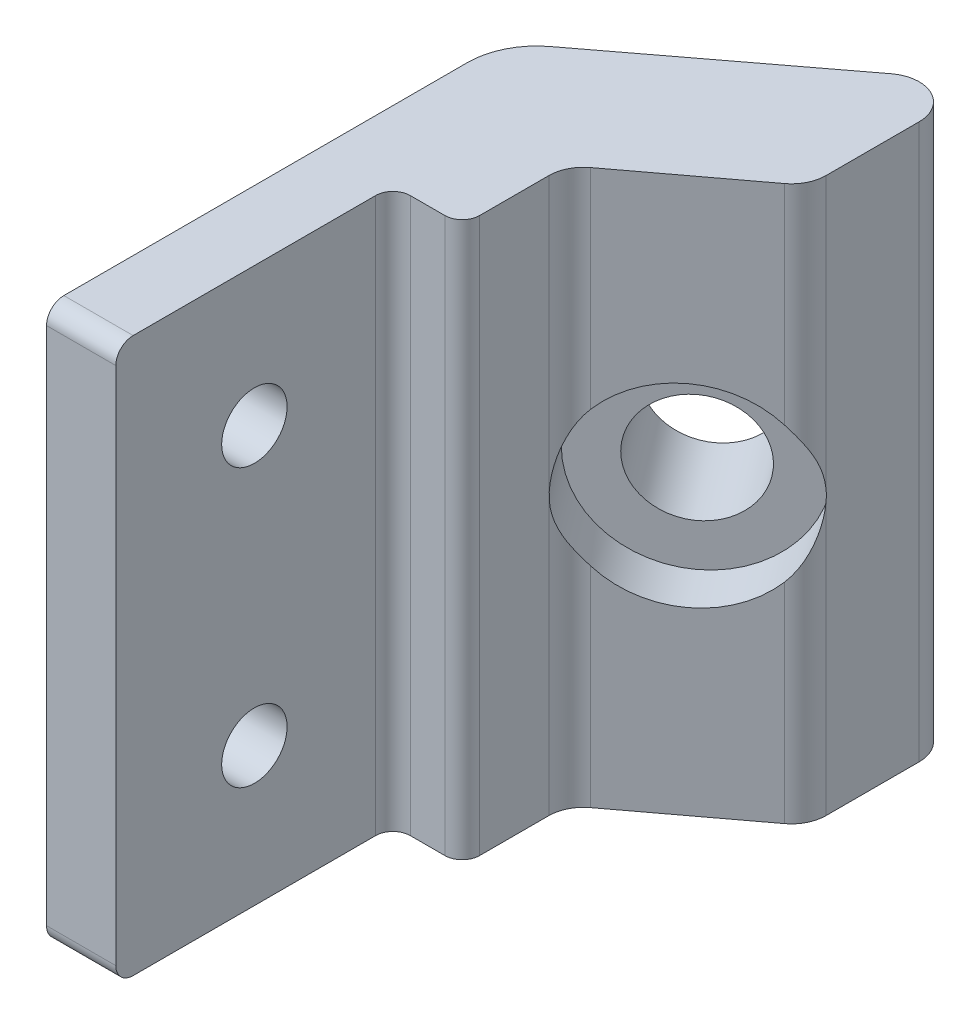
ISO-10303-21;
HEADER;
FILE_DESCRIPTION(('STEP AP214'),'2;1');
FILE_NAME('part.step','',(''),(''),'','','');
FILE_SCHEMA(('AUTOMOTIVE_DESIGN { 1 0 10303 214 1 1 1 1 }'));
ENDSEC;
DATA;
#1=APPLICATION_CONTEXT('core data for automotive mechanical design processes');
#2=APPLICATION_PROTOCOL_DEFINITION('international standard','automotive_design',2000,#1);
#3=PRODUCT_CONTEXT('',#1,'mechanical');
#4=PRODUCT('Part','Part','',(#3));
#5=PRODUCT_RELATED_PRODUCT_CATEGORY('part','',(#4));
#6=PRODUCT_DEFINITION_FORMATION('','',#4);
#7=PRODUCT_DEFINITION_CONTEXT('part definition',#1,'design');
#8=PRODUCT_DEFINITION('design','',#6,#7);
#9=PRODUCT_DEFINITION_SHAPE('','',#8);
#10=(LENGTH_UNIT() NAMED_UNIT(*) SI_UNIT(.MILLI.,.METRE.));
#11=(NAMED_UNIT(*) PLANE_ANGLE_UNIT() SI_UNIT($,.RADIAN.));
#12=(NAMED_UNIT(*) SI_UNIT($,.STERADIAN.) SOLID_ANGLE_UNIT());
#13=UNCERTAINTY_MEASURE_WITH_UNIT(LENGTH_MEASURE(1.E-05),#10,'distance_accuracy_value','');
#14=(GEOMETRIC_REPRESENTATION_CONTEXT(3) GLOBAL_UNCERTAINTY_ASSIGNED_CONTEXT((#13)) GLOBAL_UNIT_ASSIGNED_CONTEXT((#10,
#11,#12)) REPRESENTATION_CONTEXT('',''));
#15=CARTESIAN_POINT('',(0.,0.,0.));
#16=DIRECTION('',(0.,0.,1.));
#17=DIRECTION('',(1.,0.,0.));
#18=AXIS2_PLACEMENT_3D('',#15,#16,#17);
#19=CARTESIAN_POINT('',(31.75,-50.8,0.));
#20=DIRECTION('',(0.,0.,1.));
#21=DIRECTION('',(1.,0.,0.));
#22=AXIS2_PLACEMENT_3D('',#19,#20,#21);
#23=PLANE('',#22);
#24=DIRECTION('',(-1.,0.,0.));
#25=VECTOR('',#24,1.);
#26=CARTESIAN_POINT('',(38.1,-1.58750000000001,0.));
#27=LINE('',#26,#25);
#28=CARTESIAN_POINT('',(38.1,-1.58750000000001,0.));
#29=VERTEX_POINT('',#28);
#30=CARTESIAN_POINT('',(31.75,-1.58750000000001,0.));
#31=VERTEX_POINT('',#30);
#32=EDGE_CURVE('E449',#29,#31,#27,.T.);
#33=ORIENTED_EDGE('',*,*,#32,.T.);
#34=DIRECTION('',(0.,1.,0.));
#35=VECTOR('',#34,1.);
#36=CARTESIAN_POINT('',(31.75,-50.8,0.));
#37=LINE('',#36,#35);
#38=CARTESIAN_POINT('',(31.75,-49.2125,0.));
#39=VERTEX_POINT('',#38);
#40=EDGE_CURVE('E190',#39,#31,#37,.T.);
#41=ORIENTED_EDGE('',*,*,#40,.F.);
#42=DIRECTION('',(-1.,0.,0.));
#43=VECTOR('',#42,1.);
#44=CARTESIAN_POINT('',(38.1,-49.2125,0.));
#45=LINE('',#44,#43);
#46=CARTESIAN_POINT('',(38.1,-49.2125,0.));
#47=VERTEX_POINT('',#46);
#48=EDGE_CURVE('E178',#47,#39,#45,.T.);
#49=ORIENTED_EDGE('',*,*,#48,.F.);
#50=DIRECTION('',(0.,1.,0.));
#51=VECTOR('',#50,1.);
#52=CARTESIAN_POINT('',(38.1,-50.8,0.));
#53=LINE('',#52,#51);
#54=EDGE_CURVE('E188',#47,#29,#53,.T.);
#55=ORIENTED_EDGE('',*,*,#54,.T.);
#56=EDGE_LOOP('',(#33,#41,#49,#55));
#57=FACE_BOUND('',#56,.T.);
#58=ADVANCED_FACE('F41',(#57),#23,.T.);
#59=CARTESIAN_POINT('',(53.975,-50.8,-46.0375));
#60=DIRECTION('',(0.,1.,0.));
#61=DIRECTION('',(0.,0.,1.));
#62=AXIS2_PLACEMENT_3D('',#59,#60,#61);
#63=CYLINDRICAL_SURFACE('',#62,3.175);
#64=CARTESIAN_POINT('',(57.15,-24.876723173018,-46.0375));
#65=CARTESIAN_POINT('',(57.14999327222,-24.783701013145,-46.0283699328731));
#66=CARTESIAN_POINT('',(57.1499610112827,-24.6909378468294,-46.0168482108093));
#67=CARTESIAN_POINT('',(57.1496662931574,-24.5061123371493,-45.9893543044143));
#68=CARTESIAN_POINT('',(57.1494039353851,-24.4140497084356,-45.973384044153));
#69=CARTESIAN_POINT('',(57.1480058395352,-24.1395594876917,-45.9193811692682));
#70=CARTESIAN_POINT('',(57.146260962046,-23.9583278715682,-45.8752037862316));
#71=CARTESIAN_POINT('',(57.1393988303292,-23.5989312238263,-45.773281370185));
#72=CARTESIAN_POINT('',(57.1342652895989,-23.4207852872265,-45.7154716847611));
#73=CARTESIAN_POINT('',(57.118843679538,-23.0683854665152,-45.5892573580935));
#74=CARTESIAN_POINT('',(57.1085513139417,-22.894134953067,-45.5208439189089));
#75=CARTESIAN_POINT('',(57.0760624908927,-22.4851526412214,-45.3488176513561));
#76=CARTESIAN_POINT('',(57.0508541100002,-22.2521651437209,-45.2416075548382));
#77=CARTESIAN_POINT('',(56.9838304278257,-21.793510646844,-45.0170460876804));
#78=CARTESIAN_POINT('',(56.942010919944,-21.5678455174534,-44.8996921541108));
#79=CARTESIAN_POINT('',(56.8385319525899,-21.1254941713354,-44.6599012757596));
#80=CARTESIAN_POINT('',(56.7769836970921,-20.908765135179,-44.5374960948833));
#81=CARTESIAN_POINT('',(56.6306287075674,-20.4842109341543,-44.2914344582644));
#82=CARTESIAN_POINT('',(56.5458459460025,-20.276376845973,-44.1677794180404));
#83=CARTESIAN_POINT('',(56.3707535869939,-19.9148763675364,-43.9503872385135));
#84=CARTESIAN_POINT('',(56.2855632109669,-19.759181015043,-43.8559402846179));
#85=CARTESIAN_POINT('',(56.144172104766,-19.5311983988009,-43.7180872146868));
#86=CARTESIAN_POINT('',(56.094642872308,-19.4559623340291,-43.6726711878565));
#87=CARTESIAN_POINT('',(55.990883866188,-19.307622196993,-43.5836237381145));
#88=CARTESIAN_POINT('',(55.9366510597576,-19.2345195415141,-43.5399934937245));
#89=CARTESIAN_POINT('',(55.88,-19.1626033587517,-43.4975));
#90=B_SPLINE_CURVE_WITH_KNOTS('',3,(#64,#65,#66,#67,#68,#69,#70,#71,#72,#73,#74,#75,#76,#77,#78,
#79,#80,#81,#82,#83,#84,#85,#86,#87,#88,#89),.UNSPECIFIED.,.F.,.F.,(4,2,2,2,2,2,2,2,2,2,2,2,4),
(0.,0.280336922210032,0.560552781607499,1.11947716922896,1.68110759606796,2.24320652740722,
3.01545670389441,3.78790256972704,4.55606881399506,5.32344545882408,5.92561931434398,
6.22811781226873,6.53081282608392),.UNSPECIFIED.);
#91=CARTESIAN_POINT('',(57.15,-24.876723173018,-46.0375));
#92=VERTEX_POINT('',#91);
#93=CARTESIAN_POINT('',(55.88,-19.1626033587517,-43.4975));
#94=VERTEX_POINT('',#93);
#95=EDGE_CURVE('E253',#92,#94,#90,.T.);
#96=ORIENTED_EDGE('',*,*,#95,.F.);
#97=DIRECTION('',(0.,1.,0.));
#98=VECTOR('',#97,1.);
#99=CARTESIAN_POINT('',(57.15,-50.8,-46.0375));
#100=LINE('',#99,#98);
#101=CARTESIAN_POINT('',(57.15,0.,-46.0375));
#102=VERTEX_POINT('',#101);
#103=EDGE_CURVE('E215',#92,#102,#100,.T.);
#104=ORIENTED_EDGE('',*,*,#103,.T.);
#105=CARTESIAN_POINT('',(53.975,0.,-46.0375));
#106=DIRECTION('',(0.,1.,0.));
#107=DIRECTION('',(0.,0.,1.));
#108=AXIS2_PLACEMENT_3D('',#105,#106,#107);
#109=CIRCLE('',#108,3.175);
#110=CARTESIAN_POINT('',(55.88,0.,-43.4975));
#111=VERTEX_POINT('',#110);
#112=EDGE_CURVE('E377',#111,#102,#109,.T.);
#113=ORIENTED_EDGE('',*,*,#112,.F.);
#114=DIRECTION('',(0.,1.,0.));
#115=VECTOR('',#114,1.);
#116=CARTESIAN_POINT('',(55.88,-50.8,-43.4975));
#117=LINE('',#116,#115);
#118=EDGE_CURVE('E219',#94,#111,#117,.T.);
#119=ORIENTED_EDGE('',*,*,#118,.F.);
#120=EDGE_LOOP('',(#96,#104,#113,#119));
#121=FACE_BOUND('',#120,.T.);
#122=ADVANCED_FACE('F301',(#121),#63,.T.);
#123=CARTESIAN_POINT('',(45.72,-50.8,-35.8775));
#124=DIRECTION('',(0.6,0.,0.8));
#125=DIRECTION('',(0.8,0.,-0.6));
#126=AXIS2_PLACEMENT_3D('',#123,#124,#125);
#127=PLANE('',#126);
#128=CARTESIAN_POINT('',(50.8123309885672,-25.4,-39.6967482414254));
#129=DIRECTION('',(0.6,0.,0.8));
#130=DIRECTION('',(0.8,0.,-0.6));
#131=AXIS2_PLACEMENT_3D('',#128,#129,#130);
#132=CIRCLE('',#131,8.88999999999999);
#133=CARTESIAN_POINT('',(45.72,-19.1940667121497,-35.8775));
#134=VERTEX_POINT('',#133);
#135=EDGE_CURVE('E234',#94,#134,#132,.T.);
#136=ORIENTED_EDGE('',*,*,#135,.F.);
#137=ORIENTED_EDGE('',*,*,#118,.T.);
#138=DIRECTION('',(0.8,0.,-0.6));
#139=VECTOR('',#138,1.);
#140=CARTESIAN_POINT('',(45.72,0.,-35.8775));
#141=LINE('',#140,#139);
#142=CARTESIAN_POINT('',(45.72,0.,-35.8775));
#143=VERTEX_POINT('',#142);
#144=EDGE_CURVE('E374',#143,#111,#141,.T.);
#145=ORIENTED_EDGE('',*,*,#144,.F.);
#146=DIRECTION('',(0.,1.,0.));
#147=VECTOR('',#146,1.);
#148=CARTESIAN_POINT('',(45.72,-50.8,-35.8775));
#149=LINE('',#148,#147);
#150=EDGE_CURVE('E223',#134,#143,#149,.T.);
#151=ORIENTED_EDGE('',*,*,#150,.F.);
#152=EDGE_LOOP('',(#136,#137,#145,#151));
#153=FACE_BOUND('',#152,.T.);
#154=ADVANCED_FACE('F277',(#153),#127,.T.);
#155=CARTESIAN_POINT('',(48.2703191722165,-25.4,-43.086097329893));
#156=DIRECTION('',(-0.603638384029419,0.,-0.797258240049202));
#157=DIRECTION('',(-0.797258240049202,0.,0.603638384029419));
#158=AXIS2_PLACEMENT_3D('',#155,#156,#157);
#159=CYLINDRICAL_SURFACE('',#158,5.);
#160=CARTESIAN_POINT('',(42.9039739381949,-25.4,-50.1737230839304));
#161=DIRECTION('',(-0.603638384029419,0.,-0.797258240049202));
#162=DIRECTION('',(-0.797258240049202,0.,0.603638384029419));
#163=AXIS2_PLACEMENT_3D('',#160,#161,#162);
#164=CIRCLE('',#163,5.);
#165=CARTESIAN_POINT('',(38.9176827379489,-25.4,-47.1555311637833));
#166=VERTEX_POINT('',#165);
#167=EDGE_CURVE('E331',#166,#166,#164,.T.);
#168=ORIENTED_EDGE('',*,*,#167,.T.);
#169=EDGE_LOOP('',(#168));
#170=FACE_BOUND('',#169,.T.);
#171=CARTESIAN_POINT('',(48.2212346289432,-25.4,-43.1509259717074));
#172=DIRECTION('',(0.6,0.,0.8));
#173=DIRECTION('',(-0.8,0.,0.6));
#174=AXIS2_PLACEMENT_3D('',#171,#172,#173);
#175=ELLIPSE('',#174,5.0000518882534,5.);
#176=CARTESIAN_POINT('',(44.2211931183405,-25.4,-40.1508948387553));
#177=VERTEX_POINT('',#176);
#178=EDGE_CURVE('E228',#177,#177,#175,.F.);
#179=ORIENTED_EDGE('',*,*,#178,.F.);
#180=EDGE_LOOP('',(#179));
#181=FACE_BOUND('',#180,.T.);
#182=ADVANCED_FACE('F272',(#170,#181),#159,.F.);
#183=CARTESIAN_POINT('',(42.8625,-50.8,-26.9875));
#184=DIRECTION('',(0.,1.,0.));
#185=DIRECTION('',(0.,0.,1.));
#186=AXIS2_PLACEMENT_3D('',#183,#184,#185);
#187=CYLINDRICAL_SURFACE('',#186,1.5875);
#188=CARTESIAN_POINT('',(42.8625,0.,-26.9875));
#189=DIRECTION('',(0.,1.,0.));
#190=DIRECTION('',(0.,0.,-1.));
#191=AXIS2_PLACEMENT_3D('',#188,#189,#190);
#192=CIRCLE('',#191,1.5875);
#193=CARTESIAN_POINT('',(42.8625,0.,-25.4));
#194=VERTEX_POINT('',#193);
#195=CARTESIAN_POINT('',(44.45,0.,-26.9875));
#196=VERTEX_POINT('',#195);
#197=EDGE_CURVE('E365',#194,#196,#192,.T.);
#198=ORIENTED_EDGE('',*,*,#197,.F.);
#199=DIRECTION('',(0.,1.,0.));
#200=VECTOR('',#199,1.);
#201=CARTESIAN_POINT('',(42.8625,-50.8,-25.4));
#202=LINE('',#201,#200);
#203=CARTESIAN_POINT('',(42.8625,-50.8,-25.4));
#204=VERTEX_POINT('',#203);
#205=EDGE_CURVE('E55',#204,#194,#202,.T.);
#206=ORIENTED_EDGE('',*,*,#205,.F.);
#207=CARTESIAN_POINT('',(42.8625,-50.8,-26.9875));
#208=DIRECTION('',(0.,1.,0.));
#209=DIRECTION('',(0.,0.,-1.));
#210=AXIS2_PLACEMENT_3D('',#207,#208,#209);
#211=CIRCLE('',#210,1.5875);
#212=CARTESIAN_POINT('',(44.45,-50.8,-26.9875));
#213=VERTEX_POINT('',#212);
#214=EDGE_CURVE('E403',#204,#213,#211,.T.);
#215=ORIENTED_EDGE('',*,*,#214,.T.);
#216=DIRECTION('',(0.,1.,0.));
#217=VECTOR('',#216,1.);
#218=CARTESIAN_POINT('',(44.45,-50.8,-26.9875));
#219=LINE('',#218,#217);
#220=EDGE_CURVE('E226',#213,#196,#219,.T.);
#221=ORIENTED_EDGE('',*,*,#220,.T.);
#222=EDGE_LOOP('',(#198,#206,#215,#221));
#223=FACE_BOUND('',#222,.T.);
#224=ADVANCED_FACE('F43',(#223),#187,.T.);
#225=CARTESIAN_POINT('',(39.6875,-50.8,-25.4));
#226=DIRECTION('',(0.,0.,1.));
#227=DIRECTION('',(1.,0.,0.));
#228=AXIS2_PLACEMENT_3D('',#225,#226,#227);
#229=PLANE('',#228);
#230=DIRECTION('',(1.,0.,0.));
#231=VECTOR('',#230,1.);
#232=CARTESIAN_POINT('',(39.6875,0.,-25.4));
#233=LINE('',#232,#231);
#234=CARTESIAN_POINT('',(39.6875,0.,-25.4));
#235=VERTEX_POINT('',#234);
#236=EDGE_CURVE('E400',#235,#194,#233,.T.);
#237=ORIENTED_EDGE('',*,*,#236,.F.);
#238=DIRECTION('',(0.,1.,0.));
#239=VECTOR('',#238,1.);
#240=CARTESIAN_POINT('',(39.6875,-50.8,-25.4));
#241=LINE('',#240,#239);
#242=CARTESIAN_POINT('',(39.6875,-50.8,-25.4));
#243=VERTEX_POINT('',#242);
#244=EDGE_CURVE('E198',#243,#235,#241,.T.);
#245=ORIENTED_EDGE('',*,*,#244,.F.);
#246=DIRECTION('',(1.,0.,0.));
#247=VECTOR('',#246,1.);
#248=CARTESIAN_POINT('',(39.6875,-50.8,-25.4));
#249=LINE('',#248,#247);
#250=EDGE_CURVE('E227',#243,#204,#249,.T.);
#251=ORIENTED_EDGE('',*,*,#250,.T.);
#252=ORIENTED_EDGE('',*,*,#205,.T.);
#253=EDGE_LOOP('',(#237,#245,#251,#252));
#254=FACE_BOUND('',#253,.T.);
#255=ADVANCED_FACE('F288',(#254),#229,.T.);
#256=CARTESIAN_POINT('',(39.6875,-50.8,-23.8125));
#257=DIRECTION('',(0.,1.,0.));
#258=DIRECTION('',(0.,0.,1.));
#259=AXIS2_PLACEMENT_3D('',#256,#257,#258);
#260=CYLINDRICAL_SURFACE('',#259,1.5875);
#261=CARTESIAN_POINT('',(39.6875,0.,-23.8125));
#262=DIRECTION('',(0.,-1.,0.));
#263=DIRECTION('',(0.,0.,1.));
#264=AXIS2_PLACEMENT_3D('',#261,#262,#263);
#265=CIRCLE('',#264,1.5875);
#266=CARTESIAN_POINT('',(38.1,0.,-23.8125));
#267=VERTEX_POINT('',#266);
#268=EDGE_CURVE('E397',#267,#235,#265,.T.);
#269=ORIENTED_EDGE('',*,*,#268,.F.);
#270=DIRECTION('',(0.,1.,0.));
#271=VECTOR('',#270,1.);
#272=CARTESIAN_POINT('',(38.1,-50.8,-23.8125));
#273=LINE('',#272,#271);
#274=CARTESIAN_POINT('',(38.1,-50.8,-23.8125));
#275=VERTEX_POINT('',#274);
#276=EDGE_CURVE('E195',#275,#267,#273,.T.);
#277=ORIENTED_EDGE('',*,*,#276,.F.);
#278=CARTESIAN_POINT('',(39.6875,-50.8,-23.8125));
#279=DIRECTION('',(0.,-1.,0.));
#280=DIRECTION('',(0.,0.,1.));
#281=AXIS2_PLACEMENT_3D('',#278,#279,#280);
#282=CIRCLE('',#281,1.5875);
#283=EDGE_CURVE('E360',#275,#243,#282,.T.);
#284=ORIENTED_EDGE('',*,*,#283,.T.);
#285=ORIENTED_EDGE('',*,*,#244,.T.);
#286=EDGE_LOOP('',(#269,#277,#284,#285));
#287=FACE_BOUND('',#286,.T.);
#288=ADVANCED_FACE('F291',(#287),#260,.F.);
#289=CARTESIAN_POINT('',(38.1,-50.8,0.));
#290=DIRECTION('',(1.,0.,0.));
#291=DIRECTION('',(0.,0.,-1.));
#292=AXIS2_PLACEMENT_3D('',#289,#290,#291);
#293=PLANE('',#292);
#294=CARTESIAN_POINT('',(38.1,-1.5875,-1.5875));
#295=DIRECTION('',(1.,0.,0.));
#296=DIRECTION('',(0.,0.,1.));
#297=AXIS2_PLACEMENT_3D('',#294,#295,#296);
#298=CIRCLE('',#297,1.5875);
#299=CARTESIAN_POINT('',(38.1,0.,-1.58750000000001));
#300=VERTEX_POINT('',#299);
#301=EDGE_CURVE('E70',#300,#29,#298,.T.);
#302=ORIENTED_EDGE('',*,*,#301,.T.);
#303=ORIENTED_EDGE('',*,*,#54,.F.);
#304=CARTESIAN_POINT('',(38.1,-49.2125,-1.5875));
#305=DIRECTION('',(1.,0.,0.));
#306=DIRECTION('',(0.,0.,-1.));
#307=AXIS2_PLACEMENT_3D('',#304,#305,#306);
#308=CIRCLE('',#307,1.5875);
#309=CARTESIAN_POINT('',(38.1,-50.8,-1.58750000000001));
#310=VERTEX_POINT('',#309);
#311=EDGE_CURVE('E175',#47,#310,#308,.T.);
#312=ORIENTED_EDGE('',*,*,#311,.T.);
#313=DIRECTION('',(0.,0.,-1.));
#314=VECTOR('',#313,1.);
#315=CARTESIAN_POINT('',(38.1,-50.8,0.));
#316=LINE('',#315,#314);
#317=EDGE_CURVE('E358',#310,#275,#316,.T.);
#318=ORIENTED_EDGE('',*,*,#317,.T.);
#319=ORIENTED_EDGE('',*,*,#276,.T.);
#320=DIRECTION('',(0.,0.,-1.));
#321=VECTOR('',#320,1.);
#322=CARTESIAN_POINT('',(38.1,0.,0.));
#323=LINE('',#322,#321);
#324=EDGE_CURVE('E395',#300,#267,#323,.T.);
#325=ORIENTED_EDGE('',*,*,#324,.F.);
#326=EDGE_LOOP('',(#302,#303,#312,#318,#319,#325));
#327=FACE_BOUND('',#326,.T.);
#328=CARTESIAN_POINT('',(38.1,-38.1,-12.7));
#329=DIRECTION('',(-1.,0.,0.));
#330=DIRECTION('',(0.,0.,1.));
#331=AXIS2_PLACEMENT_3D('',#328,#329,#330);
#332=CIRCLE('',#331,3.);
#333=CARTESIAN_POINT('',(38.1,-38.1,-9.7));
#334=VERTEX_POINT('',#333);
#335=EDGE_CURVE('E444',#334,#334,#332,.T.);
#336=ORIENTED_EDGE('',*,*,#335,.T.);
#337=EDGE_LOOP('',(#336));
#338=FACE_BOUND('',#337,.T.);
#339=CARTESIAN_POINT('',(38.1,-12.7,-12.7));
#340=DIRECTION('',(-1.,0.,0.));
#341=DIRECTION('',(0.,0.,1.));
#342=AXIS2_PLACEMENT_3D('',#339,#340,#341);
#343=CIRCLE('',#342,3.);
#344=CARTESIAN_POINT('',(38.1,-12.7,-9.7));
#345=VERTEX_POINT('',#344);
#346=EDGE_CURVE('E237',#345,#345,#343,.T.);
#347=ORIENTED_EDGE('',*,*,#346,.T.);
#348=EDGE_LOOP('',(#347));
#349=FACE_BOUND('',#348,.T.);
#350=ADVANCED_FACE('F192',(#327,#338,#349),#293,.T.);
#351=CARTESIAN_POINT('',(31.75,-50.8,0.));
#352=DIRECTION('',(-1.,0.,0.));
#353=DIRECTION('',(0.,0.,1.));
#354=AXIS2_PLACEMENT_3D('',#351,#352,#353);
#355=PLANE('',#354);
#356=CARTESIAN_POINT('',(31.75,-1.5875,-1.5875));
#357=DIRECTION('',(1.,0.,0.));
#358=DIRECTION('',(0.,0.,1.));
#359=AXIS2_PLACEMENT_3D('',#356,#357,#358);
#360=CIRCLE('',#359,1.5875);
#361=CARTESIAN_POINT('',(31.75,0.,-1.58750000000001));
#362=VERTEX_POINT('',#361);
#363=EDGE_CURVE('E450',#362,#31,#360,.T.);
#364=ORIENTED_EDGE('',*,*,#363,.F.);
#365=DIRECTION('',(0.,0.,1.));
#366=VECTOR('',#365,1.);
#367=CARTESIAN_POINT('',(31.75,0.,0.));
#368=LINE('',#367,#366);
#369=CARTESIAN_POINT('',(31.75,0.,-38.5716315653772));
#370=VERTEX_POINT('',#369);
#371=EDGE_CURVE('E392',#370,#362,#368,.T.);
#372=ORIENTED_EDGE('',*,*,#371,.F.);
#373=DIRECTION('',(0.,1.,0.));
#374=VECTOR('',#373,1.);
#375=CARTESIAN_POINT('',(31.75,-50.8,-38.5716315653772));
#376=LINE('',#375,#374);
#377=CARTESIAN_POINT('',(31.75,-50.8,-38.5716315653772));
#378=VERTEX_POINT('',#377);
#379=EDGE_CURVE('E200',#378,#370,#376,.T.);
#380=ORIENTED_EDGE('',*,*,#379,.F.);
#381=DIRECTION('',(0.,0.,1.));
#382=VECTOR('',#381,1.);
#383=CARTESIAN_POINT('',(31.75,-50.8,-13.171631630758));
#384=LINE('',#383,#382);
#385=CARTESIAN_POINT('',(31.75,-50.8,-1.58750000000001));
#386=VERTEX_POINT('',#385);
#387=EDGE_CURVE('E355',#378,#386,#384,.T.);
#388=ORIENTED_EDGE('',*,*,#387,.T.);
#389=CARTESIAN_POINT('',(31.75,-49.2125,-1.5875));
#390=DIRECTION('',(1.,0.,0.));
#391=DIRECTION('',(0.,0.,-1.));
#392=AXIS2_PLACEMENT_3D('',#389,#390,#391);
#393=CIRCLE('',#392,1.5875);
#394=EDGE_CURVE('E62',#39,#386,#393,.T.);
#395=ORIENTED_EDGE('',*,*,#394,.F.);
#396=ORIENTED_EDGE('',*,*,#40,.T.);
#397=EDGE_LOOP('',(#364,#372,#380,#388,#395,#396));
#398=FACE_BOUND('',#397,.T.);
#399=CARTESIAN_POINT('',(31.75,-38.1,-12.7));
#400=DIRECTION('',(-1.,0.,0.));
#401=DIRECTION('',(0.,0.,1.));
#402=AXIS2_PLACEMENT_3D('',#399,#400,#401);
#403=CIRCLE('',#402,3.);
#404=CARTESIAN_POINT('',(31.75,-38.1,-9.7));
#405=VERTEX_POINT('',#404);
#406=EDGE_CURVE('E441',#405,#405,#403,.T.);
#407=ORIENTED_EDGE('',*,*,#406,.F.);
#408=EDGE_LOOP('',(#407));
#409=FACE_BOUND('',#408,.T.);
#410=CARTESIAN_POINT('',(31.75,-12.7,-12.7));
#411=DIRECTION('',(-1.,0.,0.));
#412=DIRECTION('',(0.,0.,1.));
#413=AXIS2_PLACEMENT_3D('',#410,#411,#412);
#414=CIRCLE('',#413,3.);
#415=CARTESIAN_POINT('',(31.75,-12.7,-9.7));
#416=VERTEX_POINT('',#415);
#417=EDGE_CURVE('E242',#416,#416,#414,.T.);
#418=ORIENTED_EDGE('',*,*,#417,.F.);
#419=EDGE_LOOP('',(#418));
#420=FACE_BOUND('',#419,.T.);
#421=ADVANCED_FACE('F298',(#398,#409,#420),#355,.T.);
#422=CARTESIAN_POINT('',(38.1,-50.8,-38.5716315653773));
#423=DIRECTION('',(0.,1.,0.));
#424=DIRECTION('',(0.,0.,1.));
#425=AXIS2_PLACEMENT_3D('',#422,#423,#424);
#426=CYLINDRICAL_SURFACE('',#425,6.35);
#427=CARTESIAN_POINT('',(38.1,0.,-38.5716315653773));
#428=DIRECTION('',(0.,1.,0.));
#429=DIRECTION('',(0.,0.,1.));
#430=AXIS2_PLACEMENT_3D('',#427,#428,#429);
#431=CIRCLE('',#430,6.35);
#432=CARTESIAN_POINT('',(34.2668962614132,0.,-43.6342213896897));
#433=VERTEX_POINT('',#432);
#434=EDGE_CURVE('E389',#433,#370,#431,.T.);
#435=ORIENTED_EDGE('',*,*,#434,.F.);
#436=DIRECTION('',(0.,1.,0.));
#437=VECTOR('',#436,1.);
#438=CARTESIAN_POINT('',(34.2668962614132,-50.8,-43.6342213896897));
#439=LINE('',#438,#437);
#440=CARTESIAN_POINT('',(34.2668962614132,-50.8,-43.6342213896897));
#441=VERTEX_POINT('',#440);
#442=EDGE_CURVE('E206',#441,#433,#439,.T.);
#443=ORIENTED_EDGE('',*,*,#442,.F.);
#444=CARTESIAN_POINT('',(38.1,-50.8,-38.5716315653773));
#445=DIRECTION('',(0.,1.,0.));
#446=DIRECTION('',(0.,0.,1.));
#447=AXIS2_PLACEMENT_3D('',#444,#445,#446);
#448=CIRCLE('',#447,6.35);
#449=EDGE_CURVE('E352',#441,#378,#448,.T.);
#450=ORIENTED_EDGE('',*,*,#449,.T.);
#451=ORIENTED_EDGE('',*,*,#379,.T.);
#452=EDGE_LOOP('',(#435,#443,#450,#451));
#453=FACE_BOUND('',#452,.T.);
#454=ADVANCED_FACE('F304',(#453),#426,.T.);
#455=CARTESIAN_POINT('',(34.2668962614132,-50.8,-43.6342213896897));
#456=DIRECTION('',(-0.603638384029419,0.,-0.797258240049202));
#457=DIRECTION('',(-0.797258240049202,0.,0.603638384029419));
#458=AXIS2_PLACEMENT_3D('',#455,#456,#457);
#459=PLANE('',#458);
#460=ORIENTED_EDGE('',*,*,#167,.F.);
#461=EDGE_LOOP('',(#460));
#462=FACE_BOUND('',#461,.T.);
#463=DIRECTION('',(-0.797258240049202,0.,0.603638384029419));
#464=VECTOR('',#463,1.);
#465=CARTESIAN_POINT('',(34.2668962614132,0.,-43.6342213896897));
#466=LINE('',#465,#464);
#467=CARTESIAN_POINT('',(52.0584481307066,0.,-57.1049678558448));
#468=VERTEX_POINT('',#467);
#469=EDGE_CURVE('E386',#468,#433,#466,.T.);
#470=ORIENTED_EDGE('',*,*,#469,.F.);
#471=DIRECTION('',(0.,1.,0.));
#472=VECTOR('',#471,1.);
#473=CARTESIAN_POINT('',(52.0584481307066,-50.8,-57.1049678558448));
#474=LINE('',#473,#472);
#475=CARTESIAN_POINT('',(52.0584481307066,-50.8,-57.1049678558448));
#476=VERTEX_POINT('',#475);
#477=EDGE_CURVE('E208',#476,#468,#474,.T.);
#478=ORIENTED_EDGE('',*,*,#477,.F.);
#479=DIRECTION('',(-0.797258240049202,0.,0.603638384029419));
#480=VECTOR('',#479,1.);
#481=CARTESIAN_POINT('',(34.2668962614132,-50.8,-43.6342213896897));
#482=LINE('',#481,#480);
#483=EDGE_CURVE('E349',#476,#441,#482,.T.);
#484=ORIENTED_EDGE('',*,*,#483,.T.);
#485=ORIENTED_EDGE('',*,*,#442,.T.);
#486=EDGE_LOOP('',(#470,#478,#484,#485));
#487=FACE_BOUND('',#486,.T.);
#488=ADVANCED_FACE('F308',(#462,#487),#459,.T.);
#489=CARTESIAN_POINT('',(53.975,-50.8,-54.5736729436886));
#490=DIRECTION('',(0.,1.,0.));
#491=DIRECTION('',(0.,0.,1.));
#492=AXIS2_PLACEMENT_3D('',#489,#490,#491);
#493=CYLINDRICAL_SURFACE('',#492,3.175);
#494=CARTESIAN_POINT('',(53.975,0.,-54.5736729436886));
#495=DIRECTION('',(0.,1.,0.));
#496=DIRECTION('',(0.,0.,1.));
#497=AXIS2_PLACEMENT_3D('',#494,#495,#496);
#498=CIRCLE('',#497,3.175);
#499=CARTESIAN_POINT('',(57.15,0.,-54.5736729436886));
#500=VERTEX_POINT('',#499);
#501=EDGE_CURVE('E383',#500,#468,#498,.T.);
#502=ORIENTED_EDGE('',*,*,#501,.F.);
#503=DIRECTION('',(0.,1.,0.));
#504=VECTOR('',#503,1.);
#505=CARTESIAN_POINT('',(57.15,-50.8,-54.5736729436886));
#506=LINE('',#505,#504);
#507=CARTESIAN_POINT('',(57.15,-50.8,-54.5736729436886));
#508=VERTEX_POINT('',#507);
#509=EDGE_CURVE('E210',#508,#500,#506,.T.);
#510=ORIENTED_EDGE('',*,*,#509,.F.);
#511=CARTESIAN_POINT('',(53.975,-50.8,-54.5736729436886));
#512=DIRECTION('',(0.,1.,0.));
#513=DIRECTION('',(0.,0.,1.));
#514=AXIS2_PLACEMENT_3D('',#511,#512,#513);
#515=CIRCLE('',#514,3.175);
#516=EDGE_CURVE('E341',#508,#476,#515,.T.);
#517=ORIENTED_EDGE('',*,*,#516,.T.);
#518=ORIENTED_EDGE('',*,*,#477,.T.);
#519=EDGE_LOOP('',(#502,#510,#517,#518));
#520=FACE_BOUND('',#519,.T.);
#521=ADVANCED_FACE('F312',(#520),#493,.T.);
#522=CARTESIAN_POINT('',(57.15,-50.8,-46.0375));
#523=DIRECTION('',(1.,0.,0.));
#524=DIRECTION('',(0.,0.,-1.));
#525=AXIS2_PLACEMENT_3D('',#522,#523,#524);
#526=PLANE('',#525);
#527=CARTESIAN_POINT('',(57.15,-25.4,-31.2465228928483));
#528=DIRECTION('',(1.,0.,0.));
#529=DIRECTION('',(0.,0.,1.));
#530=AXIS2_PLACEMENT_3D('',#527,#528,#529);
#531=ELLIPSE('',#530,14.8166666666666,8.88999999999999);
#532=CARTESIAN_POINT('',(57.15,-25.9232768269819,-46.0375));
#533=VERTEX_POINT('',#532);
#534=EDGE_CURVE('E326',#533,#92,#531,.T.);
#535=ORIENTED_EDGE('',*,*,#534,.F.);
#536=CARTESIAN_POINT('',(57.15,-50.8,-46.0375));
#537=VERTEX_POINT('',#536);
#538=EDGE_CURVE('E212',#537,#533,#100,.T.);
#539=ORIENTED_EDGE('',*,*,#538,.F.);
#540=DIRECTION('',(0.,0.,-1.));
#541=VECTOR('',#540,1.);
#542=CARTESIAN_POINT('',(57.15,-50.8,-46.0375));
#543=LINE('',#542,#541);
#544=EDGE_CURVE('E338',#537,#508,#543,.T.);
#545=ORIENTED_EDGE('',*,*,#544,.T.);
#546=ORIENTED_EDGE('',*,*,#509,.T.);
#547=DIRECTION('',(0.,0.,-1.));
#548=VECTOR('',#547,1.);
#549=CARTESIAN_POINT('',(57.15,0.,-46.0375));
#550=LINE('',#549,#548);
#551=EDGE_CURVE('E380',#102,#500,#550,.T.);
#552=ORIENTED_EDGE('',*,*,#551,.F.);
#553=ORIENTED_EDGE('',*,*,#103,.F.);
#554=EDGE_LOOP('',(#535,#539,#545,#546,#552,#553));
#555=FACE_BOUND('',#554,.T.);
#556=ADVANCED_FACE('F315',(#555),#526,.T.);
#557=CARTESIAN_POINT('',(55.88,-31.6373966412483,-43.4975));
#558=CARTESIAN_POINT('',(55.9783011068802,-31.5126153824696,-43.5712758790674));
#559=CARTESIAN_POINT('',(56.0692862931761,-31.3842962622213,-43.6483774142773));
#560=CARTESIAN_POINT('',(56.2373790814041,-31.1218019760011,-43.8068859405237));
#561=CARTESIAN_POINT('',(56.3145140814595,-30.987639038647,-43.8882840098881));
#562=CARTESIAN_POINT('',(56.4556986593123,-30.714842227164,-44.0529465813036));
#563=CARTESIAN_POINT('',(56.5198107159468,-30.5762335815418,-44.136199937569));
#564=CARTESIAN_POINT('',(56.6365064975585,-30.2945117269357,-44.3033137002538));
#565=CARTESIAN_POINT('',(56.6890831503575,-30.1513958157533,-44.3871744466937));
#566=CARTESIAN_POINT('',(56.8069763972882,-29.7899411119962,-44.5949401056725));
#567=CARTESIAN_POINT('',(56.8658696972688,-29.569176077586,-44.7182858012749));
#568=CARTESIAN_POINT('',(56.9638421559135,-29.1197935660637,-44.9584880790388));
#569=CARTESIAN_POINT('',(57.0029100159975,-28.8911716903732,-45.0753409272042));
#570=CARTESIAN_POINT('',(57.064814697386,-28.4265413882841,-45.2979116346426));
#571=CARTESIAN_POINT('',(57.0876564717694,-28.1905352389516,-45.4036328834813));
#572=CARTESIAN_POINT('',(57.1210486202718,-27.7110164711278,-45.5984688896633));
#573=CARTESIAN_POINT('',(57.1316097939695,-27.4675106416324,-45.6875981799679));
#574=CARTESIAN_POINT('',(57.1411227553341,-27.114703294312,-45.7979133210602));
#575=CARTESIAN_POINT('',(57.143259119525,-27.008470898173,-45.8287627424049));
#576=CARTESIAN_POINT('',(57.1464868822948,-26.7947010610106,-45.885514858676));
#577=CARTESIAN_POINT('',(57.1475786257756,-26.6871640626106,-45.911419184059));
#578=CARTESIAN_POINT('',(57.149081600361,-26.4708280563545,-45.9576585435388));
#579=CARTESIAN_POINT('',(57.1494924971595,-26.3620284549277,-45.9779908375971));
#580=CARTESIAN_POINT('',(57.1499452623647,-26.1433666927616,-46.0125100410679));
#581=CARTESIAN_POINT('',(57.1499868125425,-26.0335036973626,-46.0266916410416));
#582=CARTESIAN_POINT('',(57.1500000000005,-25.9232768269818,-46.0374999999994));
#583=B_SPLINE_CURVE_WITH_KNOTS('',3,(#557,#558,#559,#560,#561,#562,#563,#564,#565,#566,#567,
#568,#569,#570,#571,#572,#573,#574,#575,#576,#577,#578,#579,#580,#581,#582),.UNSPECIFIED.,.F.,
.F.,(4,2,2,2,2,2,2,2,2,2,2,2,4),(0.,0.524955176921924,1.04886017563004,1.57018901870352,
2.09183659282254,2.86965836776345,3.64792292932949,4.42594982025061,5.2032919944764,
5.53511963307122,5.8668376744818,6.19871854625097,6.53088533874545),.UNSPECIFIED.);
#584=CARTESIAN_POINT('',(55.88,-31.6373966412483,-43.4975));
#585=VERTEX_POINT('',#584);
#586=EDGE_CURVE('E246',#585,#533,#583,.T.);
#587=ORIENTED_EDGE('',*,*,#586,.F.);
#588=CARTESIAN_POINT('',(55.88,-50.8,-43.4975));
#589=VERTEX_POINT('',#588);
#590=EDGE_CURVE('E216',#589,#585,#117,.T.);
#591=ORIENTED_EDGE('',*,*,#590,.F.);
#592=CARTESIAN_POINT('',(53.975,-50.8,-46.0375));
#593=DIRECTION('',(0.,1.,0.));
#594=DIRECTION('',(0.,0.,1.));
#595=AXIS2_PLACEMENT_3D('',#592,#593,#594);
#596=CIRCLE('',#595,3.175);
#597=EDGE_CURVE('E335',#589,#537,#596,.T.);
#598=ORIENTED_EDGE('',*,*,#597,.T.);
#599=ORIENTED_EDGE('',*,*,#538,.T.);
#600=EDGE_LOOP('',(#587,#591,#598,#599));
#601=FACE_BOUND('',#600,.T.);
#602=ADVANCED_FACE('F259',(#601),#63,.T.);
#603=CARTESIAN_POINT('',(45.72,-31.6059332878503,-35.8775));
#604=VERTEX_POINT('',#603);
#605=EDGE_CURVE('E230',#604,#585,#132,.T.);
#606=ORIENTED_EDGE('',*,*,#605,.F.);
#607=CARTESIAN_POINT('',(45.72,-50.8,-35.8775));
#608=VERTEX_POINT('',#607);
#609=EDGE_CURVE('E220',#608,#604,#149,.T.);
#610=ORIENTED_EDGE('',*,*,#609,.F.);
#611=DIRECTION('',(0.8,0.,-0.6));
#612=VECTOR('',#611,1.);
#613=CARTESIAN_POINT('',(45.72,-50.8,-35.8775));
#614=LINE('',#613,#612);
#615=EDGE_CURVE('E339',#608,#589,#614,.T.);
#616=ORIENTED_EDGE('',*,*,#615,.T.);
#617=ORIENTED_EDGE('',*,*,#590,.T.);
#618=EDGE_LOOP('',(#606,#610,#616,#617));
#619=FACE_BOUND('',#618,.T.);
#620=ADVANCED_FACE('F322',(#619),#127,.T.);
#621=CARTESIAN_POINT('',(47.625,-50.8,-33.3375));
#622=DIRECTION('',(0.,1.,0.));
#623=DIRECTION('',(0.,0.,1.));
#624=AXIS2_PLACEMENT_3D('',#621,#622,#623);
#625=CYLINDRICAL_SURFACE('',#624,3.175);
#626=CARTESIAN_POINT('',(45.72,-19.1940667121497,-35.8775));
#627=CARTESIAN_POINT('',(45.6214080171741,-19.3204648865049,-35.8035044672821));
#628=CARTESIAN_POINT('',(45.5302196100044,-19.4504379794842,-35.7261992195021));
#629=CARTESIAN_POINT('',(45.3618648901966,-19.7162993397429,-35.5673581683253));
#630=CARTESIAN_POINT('',(45.2846706156998,-19.8521751236352,-35.4858312291859));
#631=CARTESIAN_POINT('',(45.1436427697488,-20.1281194424702,-35.3212189860209));
#632=CARTESIAN_POINT('',(45.0797161737593,-20.2681503287117,-35.2381493140034));
#633=CARTESIAN_POINT('',(44.9634153281681,-20.5527547448147,-35.0715474355547));
#634=CARTESIAN_POINT('',(44.9110483075784,-20.697331053055,-34.9880149729875));
#635=CARTESIAN_POINT('',(44.7940506573719,-21.0613276289329,-34.7819321758006));
#636=CARTESIAN_POINT('',(44.7357231982337,-21.283152813819,-34.6600341200569));
#637=CARTESIAN_POINT('',(44.63863178964,-21.7346790835501,-34.4231385674004));
#638=CARTESIAN_POINT('',(44.5998777723617,-21.9643841038657,-34.3081445998623));
#639=CARTESIAN_POINT('',(44.5382147565409,-22.4320886999931,-34.0893788648046));
#640=CARTESIAN_POINT('',(44.5153591264728,-22.6701134229106,-33.9856458725255));
#641=CARTESIAN_POINT('',(44.4817277925777,-23.1537677259853,-33.7955087350507));
#642=CARTESIAN_POINT('',(44.4709442582201,-23.3993922701464,-33.7090933867186));
#643=CARTESIAN_POINT('',(44.4594118982986,-23.8111157278613,-33.5865978612508));
#644=CARTESIAN_POINT('',(44.4564745626302,-23.9750575600042,-33.5434755567912));
#645=CARTESIAN_POINT('',(44.4525439613263,-24.3057460787061,-33.4698348617482));
#646=CARTESIAN_POINT('',(44.4515497657826,-24.4724913850822,-33.4393104478454));
#647=CARTESIAN_POINT('',(44.4503996361959,-24.8070369105035,-33.39302191995));
#648=CARTESIAN_POINT('',(44.4502386775725,-24.9748246830949,-33.3771698065053));
#649=CARTESIAN_POINT('',(44.450077273787,-25.3111530530063,-33.3611743450382));
#650=CARTESIAN_POINT('',(44.4500768161565,-25.4796935908316,-33.361029776795));
#651=CARTESIAN_POINT('',(44.450230648953,-25.8160000128375,-33.3764579448409));
#652=CARTESIAN_POINT('',(44.4503849028493,-25.9837660704946,-33.392026970834));
#653=CARTESIAN_POINT('',(44.4514988149637,-26.317285639643,-33.4376328638684));
#654=CARTESIAN_POINT('',(44.4524586241007,-26.483038768113,-33.4676724414867));
#655=CARTESIAN_POINT('',(44.458207012489,-26.9783548813453,-33.5769995020991));
#656=CARTESIAN_POINT('',(44.465889762038,-27.303716064643,-33.6753460214362));
#657=CARTESIAN_POINT('',(44.4953927837752,-27.8710704042635,-33.8800972636128));
#658=CARTESIAN_POINT('',(44.5137512631089,-28.1157259538836,-33.9800286118719));
#659=CARTESIAN_POINT('',(44.5656950514253,-28.5974248600481,-34.1938934134109));
#660=CARTESIAN_POINT('',(44.5992898060747,-28.834463396693,-34.3078355206172));
#661=CARTESIAN_POINT('',(44.685408669706,-29.299190296103,-34.5437852712193));
#662=CARTESIAN_POINT('',(44.7378199221675,-29.5269255749036,-34.6657413597296));
#663=CARTESIAN_POINT('',(44.865268608048,-29.9735958986499,-34.9135469925122));
#664=CARTESIAN_POINT('',(44.9402857343877,-30.1925386428,-35.0393929517977));
#665=CARTESIAN_POINT('',(45.1154496989273,-30.6172742018798,-35.2882938352381));
#666=CARTESIAN_POINT('',(45.2152151883541,-30.82321195539,-35.4113627324621));
#667=CARTESIAN_POINT('',(45.3869138946986,-31.1234565871035,-35.5910557501172));
#668=CARTESIAN_POINT('',(45.4480568722407,-31.2224017439337,-35.6503195388185));
#669=CARTESIAN_POINT('',(45.5781117404339,-31.4168654597613,-35.7661726727518));
#670=CARTESIAN_POINT('',(45.6470318819853,-31.5123802351266,-35.8227590854832));
#671=CARTESIAN_POINT('',(45.72,-31.6059332878503,-35.8775));
#672=B_SPLINE_CURVE_WITH_KNOTS('',3,(#626,#627,#628,#629,#630,#631,#632,#633,#634,#635,#636,
#637,#638,#639,#640,#641,#642,#643,#644,#645,#646,#647,#648,#649,#650,#651,#652,#653,#654,#655,
#656,#657,#658,#659,#660,#661,#662,#663,#664,#665,#666,#667,#668,#669,#670,#671),.UNSPECIFIED.,
.F.,.F.,(4,2,2,2,2,2,2,2,2,2,2,2,2,2,2,2,2,2,2,2,2,2,4),(0.,0.529178226017622,1.05728715107452,
1.58155792534727,2.10615563979504,2.88426875319356,3.66277630985409,4.44388474827806,
5.22448622882801,5.73270695872199,6.2406844151876,6.74559507073438,7.25046650291023,
7.75521875266018,8.26006558775543,9.27647033892591,10.0704448850324,10.8649123266709,
11.6546922502265,12.4437648109902,13.2213612730247,13.6127114287374,14.0044807475262),.UNSPECIFIED.);
#673=EDGE_CURVE('E11',#134,#604,#672,.T.);
#674=ORIENTED_EDGE('',*,*,#673,.F.);
#675=ORIENTED_EDGE('',*,*,#150,.T.);
#676=CARTESIAN_POINT('',(47.625,0.,-33.3375));
#677=DIRECTION('',(0.,-1.,0.));
#678=DIRECTION('',(0.,0.,1.));
#679=AXIS2_PLACEMENT_3D('',#676,#677,#678);
#680=CIRCLE('',#679,3.175);
#681=CARTESIAN_POINT('',(44.45,0.,-33.3375));
#682=VERTEX_POINT('',#681);
#683=EDGE_CURVE('E371',#682,#143,#680,.T.);
#684=ORIENTED_EDGE('',*,*,#683,.F.);
#685=DIRECTION('',(0.,1.,0.));
#686=VECTOR('',#685,1.);
#687=CARTESIAN_POINT('',(44.45,-50.8,-33.3375));
#688=LINE('',#687,#686);
#689=CARTESIAN_POINT('',(44.45,-50.8,-33.3375));
#690=VERTEX_POINT('',#689);
#691=EDGE_CURVE('E224',#690,#682,#688,.T.);
#692=ORIENTED_EDGE('',*,*,#691,.F.);
#693=CARTESIAN_POINT('',(47.625,-50.8,-33.3375));
#694=DIRECTION('',(0.,-1.,0.));
#695=DIRECTION('',(0.,0.,1.));
#696=AXIS2_PLACEMENT_3D('',#693,#694,#695);
#697=CIRCLE('',#696,3.175);
#698=EDGE_CURVE('E343',#690,#608,#697,.T.);
#699=ORIENTED_EDGE('',*,*,#698,.T.);
#700=ORIENTED_EDGE('',*,*,#609,.T.);
#701=EDGE_LOOP('',(#674,#675,#684,#692,#699,#700));
#702=FACE_BOUND('',#701,.T.);
#703=ADVANCED_FACE('F423',(#702),#625,.F.);
#704=CARTESIAN_POINT('',(44.45,-50.8,-26.9875));
#705=DIRECTION('',(1.,0.,0.));
#706=DIRECTION('',(0.,0.,-1.));
#707=AXIS2_PLACEMENT_3D('',#704,#705,#706);
#708=PLANE('',#707);
#709=DIRECTION('',(0.,0.,-1.));
#710=VECTOR('',#709,1.);
#711=CARTESIAN_POINT('',(44.45,0.,-26.9875));
#712=LINE('',#711,#710);
#713=EDGE_CURVE('E368',#196,#682,#712,.T.);
#714=ORIENTED_EDGE('',*,*,#713,.F.);
#715=ORIENTED_EDGE('',*,*,#220,.F.);
#716=DIRECTION('',(0.,0.,-1.));
#717=VECTOR('',#716,1.);
#718=CARTESIAN_POINT('',(44.45,-50.8,-26.9875));
#719=LINE('',#718,#717);
#720=EDGE_CURVE('E418',#213,#690,#719,.T.);
#721=ORIENTED_EDGE('',*,*,#720,.T.);
#722=ORIENTED_EDGE('',*,*,#691,.T.);
#723=EDGE_LOOP('',(#714,#715,#721,#722));
#724=FACE_BOUND('',#723,.T.);
#725=ADVANCED_FACE('F283',(#724),#708,.T.);
#726=CARTESIAN_POINT('',(42.8625,-50.8,-26.9875));
#727=DIRECTION('',(0.,-1.,0.));
#728=DIRECTION('',(0.,0.,-1.));
#729=AXIS2_PLACEMENT_3D('',#726,#727,#728);
#730=PLANE('',#729);
#731=DIRECTION('',(-1.,0.,0.));
#732=VECTOR('',#731,1.);
#733=CARTESIAN_POINT('',(38.1,-50.8,-1.58750000000001));
#734=LINE('',#733,#732);
#735=EDGE_CURVE('E179',#310,#386,#734,.T.);
#736=ORIENTED_EDGE('',*,*,#735,.T.);
#737=ORIENTED_EDGE('',*,*,#387,.F.);
#738=ORIENTED_EDGE('',*,*,#449,.F.);
#739=ORIENTED_EDGE('',*,*,#483,.F.);
#740=ORIENTED_EDGE('',*,*,#516,.F.);
#741=ORIENTED_EDGE('',*,*,#544,.F.);
#742=ORIENTED_EDGE('',*,*,#597,.F.);
#743=ORIENTED_EDGE('',*,*,#615,.F.);
#744=ORIENTED_EDGE('',*,*,#698,.F.);
#745=ORIENTED_EDGE('',*,*,#720,.F.);
#746=ORIENTED_EDGE('',*,*,#214,.F.);
#747=ORIENTED_EDGE('',*,*,#250,.F.);
#748=ORIENTED_EDGE('',*,*,#283,.F.);
#749=ORIENTED_EDGE('',*,*,#317,.F.);
#750=EDGE_LOOP('',(#736,#737,#738,#739,#740,#741,#742,#743,#744,#745,#746,#747,#748,#749));
#751=FACE_BOUND('',#750,.T.);
#752=ADVANCED_FACE('F279',(#751),#730,.T.);
#753=CARTESIAN_POINT('',(42.8625,0.,-26.9875));
#754=DIRECTION('',(0.,-1.,0.));
#755=DIRECTION('',(0.,0.,-1.));
#756=AXIS2_PLACEMENT_3D('',#753,#754,#755);
#757=PLANE('',#756);
#758=ORIENTED_EDGE('',*,*,#371,.T.);
#759=DIRECTION('',(-1.,0.,0.));
#760=VECTOR('',#759,1.);
#761=CARTESIAN_POINT('',(38.1,0.,-1.58750000000001));
#762=LINE('',#761,#760);
#763=EDGE_CURVE('E452',#300,#362,#762,.T.);
#764=ORIENTED_EDGE('',*,*,#763,.F.);
#765=ORIENTED_EDGE('',*,*,#324,.T.);
#766=ORIENTED_EDGE('',*,*,#268,.T.);
#767=ORIENTED_EDGE('',*,*,#236,.T.);
#768=ORIENTED_EDGE('',*,*,#197,.T.);
#769=ORIENTED_EDGE('',*,*,#713,.T.);
#770=ORIENTED_EDGE('',*,*,#683,.T.);
#771=ORIENTED_EDGE('',*,*,#144,.T.);
#772=ORIENTED_EDGE('',*,*,#112,.T.);
#773=ORIENTED_EDGE('',*,*,#551,.T.);
#774=ORIENTED_EDGE('',*,*,#501,.T.);
#775=ORIENTED_EDGE('',*,*,#469,.T.);
#776=ORIENTED_EDGE('',*,*,#434,.T.);
#777=EDGE_LOOP('',(#758,#764,#765,#766,#767,#768,#769,#770,#771,#772,#773,#774,#775,#776));
#778=FACE_BOUND('',#777,.T.);
#779=ADVANCED_FACE('F282',(#778),#757,.F.);
#780=CARTESIAN_POINT('',(48.2215309885672,-25.4,-43.1511482414254));
#781=DIRECTION('',(0.6,0.,0.8));
#782=DIRECTION('',(0.8,0.,-0.6));
#783=AXIS2_PLACEMENT_3D('',#780,#781,#782);
#784=PLANE('',#783);
#785=CARTESIAN_POINT('',(48.2215309885672,-25.4,-43.1511482414254));
#786=DIRECTION('',(0.6,0.,0.8));
#787=DIRECTION('',(0.8,0.,-0.6));
#788=AXIS2_PLACEMENT_3D('',#785,#786,#787);
#789=CIRCLE('',#788,8.88999999999999);
#790=CARTESIAN_POINT('',(55.3335309885671,-25.4,-48.4851482414254));
#791=VERTEX_POINT('',#790);
#792=EDGE_CURVE('E231',#791,#791,#789,.T.);
#793=ORIENTED_EDGE('',*,*,#792,.T.);
#794=EDGE_LOOP('',(#793));
#795=FACE_BOUND('',#794,.T.);
#796=ORIENTED_EDGE('',*,*,#178,.T.);
#797=EDGE_LOOP('',(#796));
#798=FACE_BOUND('',#797,.T.);
#799=ADVANCED_FACE('F269',(#795,#798),#784,.T.);
#800=CARTESIAN_POINT('',(48.2215309885672,-25.4,-43.1511482414254));
#801=DIRECTION('',(0.6,0.,0.8));
#802=DIRECTION('',(0.8,0.,-0.6));
#803=AXIS2_PLACEMENT_3D('',#800,#801,#802);
#804=CYLINDRICAL_SURFACE('',#803,8.88999999999999);
#805=ORIENTED_EDGE('',*,*,#534,.T.);
#806=ORIENTED_EDGE('',*,*,#95,.T.);
#807=ORIENTED_EDGE('',*,*,#135,.T.);
#808=ORIENTED_EDGE('',*,*,#673,.T.);
#809=ORIENTED_EDGE('',*,*,#605,.T.);
#810=ORIENTED_EDGE('',*,*,#586,.T.);
#811=EDGE_LOOP('',(#805,#806,#807,#808,#809,#810));
#812=FACE_BOUND('',#811,.T.);
#813=ORIENTED_EDGE('',*,*,#792,.F.);
#814=EDGE_LOOP('',(#813));
#815=FACE_BOUND('',#814,.T.);
#816=ADVANCED_FACE('F263',(#812,#815),#804,.F.);
#817=CARTESIAN_POINT('',(38.1,-1.5875,-1.5875));
#818=DIRECTION('',(-1.,0.,0.));
#819=DIRECTION('',(0.,0.,1.));
#820=AXIS2_PLACEMENT_3D('',#817,#818,#819);
#821=CYLINDRICAL_SURFACE('',#820,1.5875);
#822=ORIENTED_EDGE('',*,*,#363,.T.);
#823=ORIENTED_EDGE('',*,*,#32,.F.);
#824=ORIENTED_EDGE('',*,*,#301,.F.);
#825=ORIENTED_EDGE('',*,*,#763,.T.);
#826=EDGE_LOOP('',(#822,#823,#824,#825));
#827=FACE_BOUND('',#826,.T.);
#828=ADVANCED_FACE('F268',(#827),#821,.T.);
#829=CARTESIAN_POINT('',(38.1,-49.2125,-1.5875));
#830=DIRECTION('',(-1.,0.,0.));
#831=DIRECTION('',(0.,0.,1.));
#832=AXIS2_PLACEMENT_3D('',#829,#830,#831);
#833=CYLINDRICAL_SURFACE('',#832,1.5875);
#834=ORIENTED_EDGE('',*,*,#394,.T.);
#835=ORIENTED_EDGE('',*,*,#735,.F.);
#836=ORIENTED_EDGE('',*,*,#311,.F.);
#837=ORIENTED_EDGE('',*,*,#48,.T.);
#838=EDGE_LOOP('',(#834,#835,#836,#837));
#839=FACE_BOUND('',#838,.T.);
#840=ADVANCED_FACE('F177',(#839),#833,.T.);
#841=CARTESIAN_POINT('',(38.1,-12.7,-12.7));
#842=DIRECTION('',(-1.,0.,0.));
#843=DIRECTION('',(0.,0.,1.));
#844=AXIS2_PLACEMENT_3D('',#841,#842,#843);
#845=CYLINDRICAL_SURFACE('',#844,3.);
#846=ORIENTED_EDGE('',*,*,#346,.F.);
#847=EDGE_LOOP('',(#846));
#848=FACE_BOUND('',#847,.T.);
#849=ORIENTED_EDGE('',*,*,#417,.T.);
#850=EDGE_LOOP('',(#849));
#851=FACE_BOUND('',#850,.T.);
#852=ADVANCED_FACE('F527',(#848,#851),#845,.F.);
#853=CARTESIAN_POINT('',(38.1,-38.1,-12.7));
#854=DIRECTION('',(-1.,0.,0.));
#855=DIRECTION('',(0.,0.,1.));
#856=AXIS2_PLACEMENT_3D('',#853,#854,#855);
#857=CYLINDRICAL_SURFACE('',#856,3.);
#858=ORIENTED_EDGE('',*,*,#335,.F.);
#859=EDGE_LOOP('',(#858));
#860=FACE_BOUND('',#859,.T.);
#861=ORIENTED_EDGE('',*,*,#406,.T.);
#862=EDGE_LOOP('',(#861));
#863=FACE_BOUND('',#862,.T.);
#864=ADVANCED_FACE('F537',(#860,#863),#857,.F.);
#865=CLOSED_SHELL('',(#58,#122,#154,#182,#224,#255,#288,#350,#421,#454,#488,#521,#556,#602,#620,
#703,#725,#752,#779,#799,#816,#828,#840,#852,#864));
#866=MANIFOLD_SOLID_BREP('B2',#865);
#867=ADVANCED_BREP_SHAPE_REPRESENTATION('',(#18,#866),#14);
#868=SHAPE_DEFINITION_REPRESENTATION(#9,#867);
ENDSEC;
END-ISO-10303-21;
